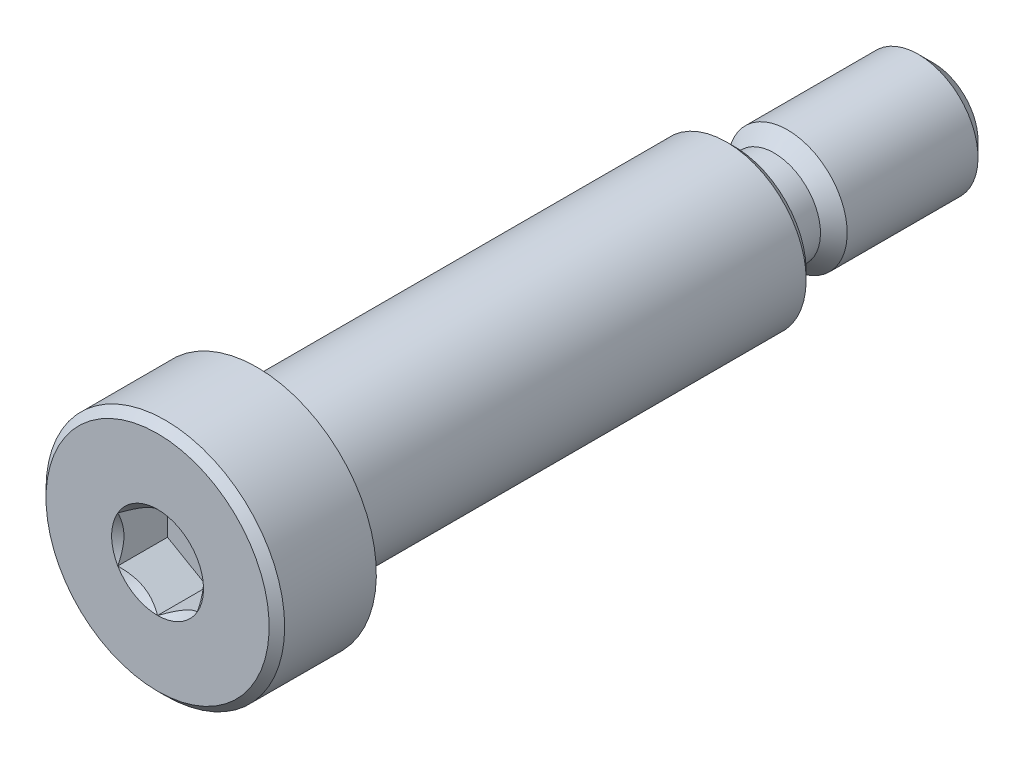
ISO-10303-21;
HEADER;
FILE_DESCRIPTION(('STEP AP214'),'2;1');
FILE_NAME('part.step','',(''),(''),'','','');
FILE_SCHEMA(('AUTOMOTIVE_DESIGN { 1 0 10303 214 1 1 1 1 }'));
ENDSEC;
DATA;
#1=APPLICATION_CONTEXT('core data for automotive mechanical design processes');
#2=APPLICATION_PROTOCOL_DEFINITION('international standard','automotive_design',2000,#1);
#3=PRODUCT_CONTEXT('',#1,'mechanical');
#4=PRODUCT('Part','Part','',(#3));
#5=PRODUCT_RELATED_PRODUCT_CATEGORY('part','',(#4));
#6=PRODUCT_DEFINITION_FORMATION('','',#4);
#7=PRODUCT_DEFINITION_CONTEXT('part definition',#1,'design');
#8=PRODUCT_DEFINITION('design','',#6,#7);
#9=PRODUCT_DEFINITION_SHAPE('','',#8);
#10=(LENGTH_UNIT() NAMED_UNIT(*) SI_UNIT(.MILLI.,.METRE.));
#11=(NAMED_UNIT(*) PLANE_ANGLE_UNIT() SI_UNIT($,.RADIAN.));
#12=(NAMED_UNIT(*) SI_UNIT($,.STERADIAN.) SOLID_ANGLE_UNIT());
#13=UNCERTAINTY_MEASURE_WITH_UNIT(LENGTH_MEASURE(1.E-05),#10,'distance_accuracy_value','');
#14=(GEOMETRIC_REPRESENTATION_CONTEXT(3) GLOBAL_UNCERTAINTY_ASSIGNED_CONTEXT((#13)) GLOBAL_UNIT_ASSIGNED_CONTEXT((#10,
#11,#12)) REPRESENTATION_CONTEXT('',''));
#15=CARTESIAN_POINT('',(0.,0.,0.));
#16=DIRECTION('',(0.,0.,1.));
#17=DIRECTION('',(1.,0.,0.));
#18=AXIS2_PLACEMENT_3D('',#15,#16,#17);
#19=CARTESIAN_POINT('',(0.,0.,0.));
#20=DIRECTION('',(0.,0.,1.));
#21=DIRECTION('',(0.,-1.,0.));
#22=AXIS2_PLACEMENT_3D('',#19,#20,#21);
#23=PLANE('',#22);
#24=CARTESIAN_POINT('',(0.,0.,0.));
#25=DIRECTION('',(0.,0.,1.));
#26=DIRECTION('',(1.,0.,0.));
#27=AXIS2_PLACEMENT_3D('',#24,#25,#26);
#28=CIRCLE('',#27,3.66617420935412);
#29=CARTESIAN_POINT('',(0.,-3.66617420935412,0.));
#30=VERTEX_POINT('',#29);
#31=CARTESIAN_POINT('',(3.175,-1.83308710467707,0.));
#32=VERTEX_POINT('',#31);
#33=EDGE_CURVE('E55',#30,#32,#28,.T.);
#34=ORIENTED_EDGE('',*,*,#33,.F.);
#35=CARTESIAN_POINT('',(-3.175,-1.83308710467706,0.));
#36=VERTEX_POINT('',#35);
#37=EDGE_CURVE('E62',#36,#30,#28,.T.);
#38=ORIENTED_EDGE('',*,*,#37,.F.);
#39=CARTESIAN_POINT('',(-3.175,1.83308710467706,0.));
#40=VERTEX_POINT('',#39);
#41=EDGE_CURVE('E135',#40,#36,#28,.T.);
#42=ORIENTED_EDGE('',*,*,#41,.F.);
#43=CARTESIAN_POINT('',(0.,3.66617420935412,0.));
#44=VERTEX_POINT('',#43);
#45=EDGE_CURVE('E130',#44,#40,#28,.T.);
#46=ORIENTED_EDGE('',*,*,#45,.F.);
#47=CARTESIAN_POINT('',(3.175,1.83308710467706,0.));
#48=VERTEX_POINT('',#47);
#49=EDGE_CURVE('E103',#48,#44,#28,.T.);
#50=ORIENTED_EDGE('',*,*,#49,.F.);
#51=EDGE_CURVE('E94',#32,#48,#28,.T.);
#52=ORIENTED_EDGE('',*,*,#51,.F.);
#53=EDGE_LOOP('',(#34,#38,#42,#46,#50,#52));
#54=FACE_BOUND('',#53,.T.);
#55=CARTESIAN_POINT('',(0.,0.,0.));
#56=DIRECTION('',(0.,0.,1.));
#57=DIRECTION('',(0.,-1.,0.));
#58=AXIS2_PLACEMENT_3D('',#55,#56,#57);
#59=CIRCLE('',#58,8.90587499999999);
#60=CARTESIAN_POINT('',(0.,-8.90587499999999,0.));
#61=VERTEX_POINT('',#60);
#62=EDGE_CURVE('E49',#61,#61,#59,.T.);
#63=ORIENTED_EDGE('',*,*,#62,.T.);
#64=EDGE_LOOP('',(#63));
#65=FACE_BOUND('',#64,.T.);
#66=ADVANCED_FACE('F35',(#54,#65),#23,.T.);
#67=CARTESIAN_POINT('',(0.,0.,-61.9125));
#68=DIRECTION('',(0.,0.,-1.));
#69=DIRECTION('',(0.,1.,0.));
#70=AXIS2_PLACEMENT_3D('',#67,#68,#69);
#71=CYLINDRICAL_SURFACE('',#70,9.525);
#72=CARTESIAN_POINT('',(0.,0.,-0.619125000000019));
#73=DIRECTION('',(0.,0.,1.));
#74=DIRECTION('',(0.,-1.,0.));
#75=AXIS2_PLACEMENT_3D('',#72,#73,#74);
#76=CIRCLE('',#75,9.525);
#77=CARTESIAN_POINT('',(0.,-9.525,-0.619125000000019));
#78=VERTEX_POINT('',#77);
#79=EDGE_CURVE('E227',#78,#78,#76,.F.);
#80=ORIENTED_EDGE('',*,*,#79,.T.);
#81=EDGE_LOOP('',(#80));
#82=FACE_BOUND('',#81,.T.);
#83=CARTESIAN_POINT('',(0.,0.,-7.93750000000001));
#84=DIRECTION('',(0.,0.,-1.));
#85=DIRECTION('',(0.,1.,0.));
#86=AXIS2_PLACEMENT_3D('',#83,#84,#85);
#87=CIRCLE('',#86,9.525);
#88=CARTESIAN_POINT('',(0.,9.525,-7.93750000000001));
#89=VERTEX_POINT('',#88);
#90=EDGE_CURVE('E242',#89,#89,#87,.T.);
#91=ORIENTED_EDGE('',*,*,#90,.F.);
#92=EDGE_LOOP('',(#91));
#93=FACE_BOUND('',#92,.T.);
#94=ADVANCED_FACE('F196',(#82,#93),#71,.T.);
#95=CARTESIAN_POINT('',(0.,-9.525,-7.93750000000001));
#96=DIRECTION('',(0.,0.,-1.));
#97=DIRECTION('',(0.,1.,0.));
#98=AXIS2_PLACEMENT_3D('',#95,#96,#97);
#99=PLANE('',#98);
#100=ORIENTED_EDGE('',*,*,#90,.T.);
#101=EDGE_LOOP('',(#100));
#102=FACE_BOUND('',#101,.T.);
#103=CARTESIAN_POINT('',(0.,0.,-7.93750000000001));
#104=DIRECTION('',(0.,0.,-1.));
#105=DIRECTION('',(0.,1.,0.));
#106=AXIS2_PLACEMENT_3D('',#103,#104,#105);
#107=CIRCLE('',#106,6.34999999999999);
#108=CARTESIAN_POINT('',(0.,6.34999999999999,-7.93750000000001));
#109=VERTEX_POINT('',#108);
#110=EDGE_CURVE('E244',#109,#109,#107,.T.);
#111=ORIENTED_EDGE('',*,*,#110,.F.);
#112=EDGE_LOOP('',(#111));
#113=FACE_BOUND('',#112,.T.);
#114=ADVANCED_FACE('F201',(#102,#113),#99,.T.);
#115=CARTESIAN_POINT('',(0.,0.,-61.9125));
#116=DIRECTION('',(0.,0.,-1.));
#117=DIRECTION('',(0.,1.,0.));
#118=AXIS2_PLACEMENT_3D('',#115,#116,#117);
#119=CYLINDRICAL_SURFACE('',#118,6.35);
#120=CARTESIAN_POINT('',(0.,0.,-45.418375));
#121=DIRECTION('',(0.,0.,-1.));
#122=DIRECTION('',(0.,1.,0.));
#123=AXIS2_PLACEMENT_3D('',#120,#121,#122);
#124=CIRCLE('',#123,6.35);
#125=CARTESIAN_POINT('',(0.,-6.34999999999999,-45.418375));
#126=VERTEX_POINT('',#125);
#127=EDGE_CURVE('E220',#126,#126,#124,.F.);
#128=ORIENTED_EDGE('',*,*,#127,.T.);
#129=EDGE_LOOP('',(#128));
#130=FACE_BOUND('',#129,.T.);
#131=ORIENTED_EDGE('',*,*,#110,.T.);
#132=EDGE_LOOP('',(#131));
#133=FACE_BOUND('',#132,.T.);
#134=ADVANCED_FACE('F345',(#130,#133),#119,.T.);
#135=CARTESIAN_POINT('',(0.,-6.35,-46.0375));
#136=DIRECTION('',(0.,0.,-1.));
#137=DIRECTION('',(0.,1.,0.));
#138=AXIS2_PLACEMENT_3D('',#135,#136,#137);
#139=PLANE('',#138);
#140=CARTESIAN_POINT('',(0.,0.,-46.0375));
#141=DIRECTION('',(0.,0.,-1.));
#142=DIRECTION('',(0.,1.,0.));
#143=AXIS2_PLACEMENT_3D('',#140,#141,#142);
#144=CIRCLE('',#143,5.73087499999999);
#145=CARTESIAN_POINT('',(0.,-5.73087499999998,-46.0375));
#146=VERTEX_POINT('',#145);
#147=EDGE_CURVE('E223',#146,#146,#144,.T.);
#148=ORIENTED_EDGE('',*,*,#147,.T.);
#149=EDGE_LOOP('',(#148));
#150=FACE_BOUND('',#149,.T.);
#151=CARTESIAN_POINT('',(0.,0.,-46.0375));
#152=DIRECTION('',(0.,0.,-1.));
#153=DIRECTION('',(0.,1.,0.));
#154=AXIS2_PLACEMENT_3D('',#151,#152,#153);
#155=CIRCLE('',#154,4.7625);
#156=CARTESIAN_POINT('',(0.,4.7625,-46.0375));
#157=VERTEX_POINT('',#156);
#158=EDGE_CURVE('E253',#157,#157,#155,.T.);
#159=ORIENTED_EDGE('',*,*,#158,.F.);
#160=EDGE_LOOP('',(#159));
#161=FACE_BOUND('',#160,.T.);
#162=ADVANCED_FACE('F352',(#150,#161),#139,.T.);
#163=CARTESIAN_POINT('',(0.,0.,-47.1043));
#164=DIRECTION('',(0.,0.,-1.));
#165=DIRECTION('',(0.,1.,0.));
#166=AXIS2_PLACEMENT_3D('',#163,#164,#165);
#167=TOROIDAL_SURFACE('',#166,4.7625,1.0668);
#168=CARTESIAN_POINT('',(0.,0.,-47.1043));
#169=DIRECTION('',(0.,0.,-1.));
#170=DIRECTION('',(0.,1.,0.));
#171=AXIS2_PLACEMENT_3D('',#168,#169,#170);
#172=CIRCLE('',#171,3.6957);
#173=CARTESIAN_POINT('',(0.,3.6957,-47.1043));
#174=VERTEX_POINT('',#173);
#175=EDGE_CURVE('E257',#174,#174,#172,.T.);
#176=ORIENTED_EDGE('',*,*,#175,.F.);
#177=EDGE_LOOP('',(#176));
#178=FACE_BOUND('',#177,.T.);
#179=ORIENTED_EDGE('',*,*,#158,.T.);
#180=EDGE_LOOP('',(#179));
#181=FACE_BOUND('',#180,.T.);
#182=ADVANCED_FACE('F360',(#178,#181),#167,.F.);
#183=CARTESIAN_POINT('',(0.,0.,-61.9125));
#184=DIRECTION('',(0.,0.,-1.));
#185=DIRECTION('',(0.,1.,0.));
#186=AXIS2_PLACEMENT_3D('',#183,#184,#185);
#187=CYLINDRICAL_SURFACE('',#186,3.6957);
#188=CARTESIAN_POINT('',(0.,0.,-49.2125));
#189=DIRECTION('',(0.,0.,-1.));
#190=DIRECTION('',(0.,1.,0.));
#191=AXIS2_PLACEMENT_3D('',#188,#189,#190);
#192=CIRCLE('',#191,3.6957);
#193=CARTESIAN_POINT('',(0.,3.6957,-49.2125));
#194=VERTEX_POINT('',#193);
#195=EDGE_CURVE('E261',#194,#194,#192,.T.);
#196=ORIENTED_EDGE('',*,*,#195,.F.);
#197=EDGE_LOOP('',(#196));
#198=FACE_BOUND('',#197,.T.);
#199=ORIENTED_EDGE('',*,*,#175,.T.);
#200=EDGE_LOOP('',(#199));
#201=FACE_BOUND('',#200,.T.);
#202=ADVANCED_FACE('F386',(#198,#201),#187,.T.);
#203=CARTESIAN_POINT('',(0.,0.,-49.2125));
#204=DIRECTION('',(0.,0.,-1.));
#205=DIRECTION('',(0.,1.,0.));
#206=AXIS2_PLACEMENT_3D('',#203,#204,#205);
#207=CONICAL_SURFACE('',#206,3.6957,0.785398163397443);
#208=CARTESIAN_POINT('',(0.,0.,-50.2793));
#209=DIRECTION('',(0.,0.,-1.));
#210=DIRECTION('',(0.,1.,0.));
#211=AXIS2_PLACEMENT_3D('',#208,#209,#210);
#212=CIRCLE('',#211,4.7625);
#213=CARTESIAN_POINT('',(0.,4.7625,-50.2793));
#214=VERTEX_POINT('',#213);
#215=EDGE_CURVE('E248',#214,#214,#212,.F.);
#216=ORIENTED_EDGE('',*,*,#215,.T.);
#217=EDGE_LOOP('',(#216));
#218=FACE_BOUND('',#217,.T.);
#219=ORIENTED_EDGE('',*,*,#195,.T.);
#220=EDGE_LOOP('',(#219));
#221=FACE_BOUND('',#220,.T.);
#222=ADVANCED_FACE('F377',(#218,#221),#207,.T.);
#223=CARTESIAN_POINT('',(0.,-4.7625,-61.9125));
#224=DIRECTION('',(0.,0.,-1.));
#225=DIRECTION('',(0.,1.,0.));
#226=AXIS2_PLACEMENT_3D('',#223,#224,#225);
#227=PLANE('',#226);
#228=CARTESIAN_POINT('',(0.,0.,-61.9125));
#229=DIRECTION('',(0.,0.,-1.));
#230=DIRECTION('',(0.,1.,0.));
#231=AXIS2_PLACEMENT_3D('',#228,#229,#230);
#232=CIRCLE('',#231,3.57187500000002);
#233=CARTESIAN_POINT('',(0.,3.57187500000002,-61.9125));
#234=VERTEX_POINT('',#233);
#235=EDGE_CURVE('E230',#234,#234,#232,.T.);
#236=ORIENTED_EDGE('',*,*,#235,.T.);
#237=EDGE_LOOP('',(#236));
#238=FACE_BOUND('',#237,.T.);
#239=ADVANCED_FACE('F368',(#238),#227,.T.);
#240=CARTESIAN_POINT('',(0.,0.,-61.9125));
#241=DIRECTION('',(0.,0.,-1.));
#242=DIRECTION('',(0.,1.,0.));
#243=AXIS2_PLACEMENT_3D('',#240,#241,#242);
#244=CYLINDRICAL_SURFACE('',#243,4.7625);
#245=CARTESIAN_POINT('',(0.,0.,-60.721875));
#246=DIRECTION('',(0.,0.,-1.));
#247=DIRECTION('',(0.,1.,0.));
#248=AXIS2_PLACEMENT_3D('',#245,#246,#247);
#249=CIRCLE('',#248,4.7625);
#250=CARTESIAN_POINT('',(0.,4.7625,-60.721875));
#251=VERTEX_POINT('',#250);
#252=EDGE_CURVE('E225',#251,#251,#249,.F.);
#253=ORIENTED_EDGE('',*,*,#252,.T.);
#254=EDGE_LOOP('',(#253));
#255=FACE_BOUND('',#254,.T.);
#256=ORIENTED_EDGE('',*,*,#215,.F.);
#257=EDGE_LOOP('',(#256));
#258=FACE_BOUND('',#257,.T.);
#259=ADVANCED_FACE('F209',(#255,#258),#244,.T.);
#260=CARTESIAN_POINT('',(0.,0.,-61.9125));
#261=DIRECTION('',(0.,0.,1.));
#262=DIRECTION('',(0.,-1.,0.));
#263=AXIS2_PLACEMENT_3D('',#260,#261,#262);
#264=CONICAL_SURFACE('',#263,3.57187500000002,0.785398163397442);
#265=ORIENTED_EDGE('',*,*,#252,.F.);
#266=EDGE_LOOP('',(#265));
#267=FACE_BOUND('',#266,.T.);
#268=ORIENTED_EDGE('',*,*,#235,.F.);
#269=EDGE_LOOP('',(#268));
#270=FACE_BOUND('',#269,.T.);
#271=ADVANCED_FACE('F206',(#267,#270),#264,.T.);
#272=CARTESIAN_POINT('',(0.,0.,-46.0375));
#273=DIRECTION('',(0.,0.,1.));
#274=DIRECTION('',(0.,-1.,0.));
#275=AXIS2_PLACEMENT_3D('',#272,#273,#274);
#276=CONICAL_SURFACE('',#275,5.73087499999999,0.78539816339745);
#277=CARTESIAN_POINT('',(0.,-6.34999999999999,-45.418375));
#278=CARTESIAN_POINT('',(0.,-6.34355078124999,-45.42482421875));
#279=CARTESIAN_POINT('',(0.,-6.33710156249999,-45.4312734375));
#280=CARTESIAN_POINT('',(0.,-6.32420312499999,-45.444171875));
#281=CARTESIAN_POINT('',(0.,-6.31775390624999,-45.45062109375));
#282=CARTESIAN_POINT('',(0.,-6.30485546874999,-45.46351953125));
#283=CARTESIAN_POINT('',(0.,-6.29840624999999,-45.46996875));
#284=CARTESIAN_POINT('',(0.,-6.28550781249999,-45.4828671875));
#285=CARTESIAN_POINT('',(0.,-6.27905859374999,-45.48931640625));
#286=CARTESIAN_POINT('',(0.,-6.26616015624999,-45.50221484375));
#287=CARTESIAN_POINT('',(0.,-6.25971093749999,-45.5086640625));
#288=CARTESIAN_POINT('',(0.,-6.24681249999999,-45.5215625));
#289=CARTESIAN_POINT('',(0.,-6.24036328124999,-45.52801171875));
#290=CARTESIAN_POINT('',(0.,-6.22746484374999,-45.54091015625));
#291=CARTESIAN_POINT('',(0.,-6.22101562499999,-45.547359375));
#292=CARTESIAN_POINT('',(0.,-6.20811718749999,-45.5602578125));
#293=CARTESIAN_POINT('',(0.,-6.20166796874999,-45.56670703125));
#294=CARTESIAN_POINT('',(0.,-6.18876953124999,-45.57960546875));
#295=CARTESIAN_POINT('',(0.,-6.18232031249999,-45.5860546875));
#296=CARTESIAN_POINT('',(0.,-6.16942187499999,-45.598953125));
#297=CARTESIAN_POINT('',(0.,-6.16297265624999,-45.60540234375));
#298=CARTESIAN_POINT('',(0.,-6.15007421874999,-45.61830078125));
#299=CARTESIAN_POINT('',(0.,-6.14362499999999,-45.62475));
#300=CARTESIAN_POINT('',(0.,-6.13072656249999,-45.6376484375));
#301=CARTESIAN_POINT('',(0.,-6.12427734374999,-45.64409765625));
#302=CARTESIAN_POINT('',(0.,-6.11137890624999,-45.65699609375));
#303=CARTESIAN_POINT('',(0.,-6.10492968749999,-45.6634453125));
#304=CARTESIAN_POINT('',(0.,-6.09203124999999,-45.67634375));
#305=CARTESIAN_POINT('',(0.,-6.08558203124999,-45.68279296875));
#306=CARTESIAN_POINT('',(0.,-6.07268359374999,-45.69569140625));
#307=CARTESIAN_POINT('',(0.,-6.06623437499999,-45.702140625));
#308=CARTESIAN_POINT('',(0.,-6.05333593749999,-45.7150390625));
#309=CARTESIAN_POINT('',(0.,-6.04688671874999,-45.72148828125));
#310=CARTESIAN_POINT('',(0.,-6.03398828124999,-45.73438671875));
#311=CARTESIAN_POINT('',(0.,-6.02753906249999,-45.7408359375));
#312=CARTESIAN_POINT('',(0.,-6.01464062499999,-45.753734375));
#313=CARTESIAN_POINT('',(0.,-6.00819140624999,-45.76018359375));
#314=CARTESIAN_POINT('',(0.,-5.99529296874999,-45.77308203125));
#315=CARTESIAN_POINT('',(0.,-5.98884374999998,-45.77953125));
#316=CARTESIAN_POINT('',(0.,-5.97594531249998,-45.7924296875));
#317=CARTESIAN_POINT('',(0.,-5.96949609374999,-45.79887890625));
#318=CARTESIAN_POINT('',(0.,-5.95659765624999,-45.81177734375));
#319=CARTESIAN_POINT('',(0.,-5.95014843749999,-45.8182265625));
#320=CARTESIAN_POINT('',(0.,-5.93724999999999,-45.831125));
#321=CARTESIAN_POINT('',(0.,-5.93080078124999,-45.83757421875));
#322=CARTESIAN_POINT('',(0.,-5.91790234374998,-45.85047265625));
#323=CARTESIAN_POINT('',(0.,-5.91145312499998,-45.856921875));
#324=CARTESIAN_POINT('',(0.,-5.89855468749998,-45.8698203125));
#325=CARTESIAN_POINT('',(0.,-5.89210546874998,-45.87626953125));
#326=CARTESIAN_POINT('',(0.,-5.87920703124998,-45.88916796875));
#327=CARTESIAN_POINT('',(0.,-5.87275781249998,-45.8956171875));
#328=CARTESIAN_POINT('',(0.,-5.85985937499998,-45.908515625));
#329=CARTESIAN_POINT('',(0.,-5.85341015624998,-45.91496484375));
#330=CARTESIAN_POINT('',(0.,-5.84051171874998,-45.92786328125));
#331=CARTESIAN_POINT('',(0.,-5.83406249999998,-45.9343125));
#332=CARTESIAN_POINT('',(0.,-5.82116406249998,-45.9472109375));
#333=CARTESIAN_POINT('',(0.,-5.81471484374998,-45.95366015625));
#334=CARTESIAN_POINT('',(0.,-5.80181640624998,-45.96655859375));
#335=CARTESIAN_POINT('',(0.,-5.79536718749998,-45.9730078125));
#336=CARTESIAN_POINT('',(0.,-5.78246874999998,-45.98590625));
#337=CARTESIAN_POINT('',(0.,-5.77601953124998,-45.99235546875));
#338=CARTESIAN_POINT('',(0.,-5.76312109374998,-46.00525390625));
#339=CARTESIAN_POINT('',(0.,-5.75667187499998,-46.011703125));
#340=CARTESIAN_POINT('',(0.,-5.74377343749998,-46.0246015625));
#341=CARTESIAN_POINT('',(0.,-5.73732421874998,-46.03105078125));
#342=CARTESIAN_POINT('',(0.,-5.73087499999998,-46.0375));
#343=B_SPLINE_CURVE_WITH_KNOTS('',3,(#277,#278,#279,#280,#281,#282,#283,#284,#285,#286,#287,
#288,#289,#290,#291,#292,#293,#294,#295,#296,#297,#298,#299,#300,#301,#302,#303,#304,#305,#306,
#307,#308,#309,#310,#311,#312,#313,#314,#315,#316,#317,#318,#319,#320,#321,#322,#323,#324,#325,
#326,#327,#328,#329,#330,#331,#332,#333,#334,#335,#336,#337,#338,#339,#340,#341,#342),
.UNSPECIFIED.,.F.,.F.,(4,2,2,2,2,2,2,2,2,2,2,2,2,2,2,2,2,2,2,2,2,2,2,2,2,2,2,2,2,2,2,2,4),(0.,
0.0273617178688837,0.0547234357377674,0.0820851536066518,0.109446871475536,0.136808589344414,
0.164170307213299,0.191532025082182,0.218893742951066,0.24625546081995,0.273617178688829,
0.300978896557713,0.328340614426597,0.355702332295481,0.38306405016436,0.410425768033244,
0.437787485902128,0.465149203771012,0.492510921639895,0.519872639508775,0.547234357377659,
0.574596075246542,0.601957793115427,0.629319510984305,0.656681228853189,0.684042946722074,
0.711404664590957,0.738766382459841,0.76612810032872,0.793489818197604,0.820851536066488,
0.848213253935372,0.875574971804251),.UNSPECIFIED.);
#344=EDGE_CURVE('BSEAM208',#126,#146,#343,.T.);
#345=ORIENTED_EDGE('',*,*,#127,.F.);
#346=ORIENTED_EDGE('',*,*,#147,.F.);
#347=ORIENTED_EDGE('',*,*,#344,.T.);
#348=ORIENTED_EDGE('',*,*,#344,.F.);
#349=EDGE_LOOP('',(#345,#347,#346,#348));
#350=FACE_BOUND('',#349,.T.);
#351=ADVANCED_FACE('F208',(#350),#276,.T.);
#352=CARTESIAN_POINT('',(0.,0.,-0.619125000000019));
#353=DIRECTION('',(0.,0.,-1.));
#354=DIRECTION('',(0.,1.,0.));
#355=AXIS2_PLACEMENT_3D('',#352,#353,#354);
#356=CONICAL_SURFACE('',#355,9.525,0.785398163397443);
#357=ORIENTED_EDGE('',*,*,#62,.F.);
#358=EDGE_LOOP('',(#357));
#359=FACE_BOUND('',#358,.T.);
#360=ORIENTED_EDGE('',*,*,#79,.F.);
#361=EDGE_LOOP('',(#360));
#362=FACE_BOUND('',#361,.T.);
#363=ADVANCED_FACE('F37',(#359,#362),#356,.T.);
#364=CARTESIAN_POINT('',(0.,0.,0.));
#365=DIRECTION('',(0.,0.,1.));
#366=DIRECTION('',(1.,0.,0.));
#367=AXIS2_PLACEMENT_3D('',#364,#365,#366);
#368=CONICAL_SURFACE('',#367,3.66617420935412,0.78539816339745);
#369=ORIENTED_EDGE('',*,*,#49,.T.);
#370=CARTESIAN_POINT('',(3.1752,1.83297163462322,0.000115475508944067));
#371=CARTESIAN_POINT('',(3.06606165005017,1.89598269034567,-0.0628410163082169));
#372=CARTESIAN_POINT('',(2.95509837192206,1.9600473688431,-0.122099895765255));
#373=CARTESIAN_POINT('',(2.72883215365405,2.09068223086865,-0.230601344269443));
#374=CARTESIAN_POINT('',(2.61350769674774,2.15726483710766,-0.279783546061288));
#375=CARTESIAN_POINT('',(2.38096147751938,2.29152545937818,-0.364033541125997));
#376=CARTESIAN_POINT('',(2.26379893371885,2.35916928558036,-0.399313085500551));
#377=CARTESIAN_POINT('',(2.02689455535372,2.49594609220167,-0.45366842986518));
#378=CARTESIAN_POINT('',(1.90715995735645,2.5650748945867,-0.47278480247036));
#379=CARTESIAN_POINT('',(1.70080208124842,2.68421566990707,-0.490032869376752));
#380=CARTESIAN_POINT('',(1.61444529227085,2.73407378526963,-0.492586066386179));
#381=CARTESIAN_POINT('',(1.44187218347529,2.83370891608763,-0.488283726876735));
#382=CARTESIAN_POINT('',(1.3556559235072,2.88348589698873,-0.481424891978556));
#383=CARTESIAN_POINT('',(1.18404020841287,2.98256827629561,-0.4586901166963));
#384=CARTESIAN_POINT('',(1.09864177574673,3.03187308438378,-0.442804090312722));
#385=CARTESIAN_POINT('',(0.929311596694528,3.1296359088415,-0.402882016002049));
#386=CARTESIAN_POINT('',(0.845379738380253,3.17809398983283,-0.37884659291483));
#387=CARTESIAN_POINT('',(0.696376420715886,3.2641210953965,-0.329394765582835));
#388=CARTESIAN_POINT('',(0.630975148808269,3.30188053733771,-0.305278280699013));
#389=CARTESIAN_POINT('',(0.501346749794894,3.3767215284027,-0.253158532862845));
#390=CARTESIAN_POINT('',(0.437119658558277,3.41380305681743,-0.225155151396475));
#391=CARTESIAN_POINT('',(0.3100419654874,3.48717139711989,-0.165889434455491));
#392=CARTESIAN_POINT('',(0.247187749251276,3.52346029578352,-0.134637346645791));
#393=CARTESIAN_POINT('',(0.122643379151907,3.59536602138644,-0.0692846556080675));
#394=CARTESIAN_POINT('',(0.0609525390212909,3.63098324454239,-0.0351858004814551));
#395=CARTESIAN_POINT('',(-0.000199999999999575,3.66628967940796,0.000115475508943787));
#396=B_SPLINE_CURVE_WITH_KNOTS('',3,(#370,#371,#372,#373,#374,#375,#376,#377,#378,#379,#380,
#381,#382,#383,#384,#385,#386,#387,#388,#389,#390,#391,#392,#393,#394,#395),.UNSPECIFIED.,.F.,
.F.,(4,2,2,2,2,2,2,2,2,2,2,2,4),(0.,0.422910572436808,0.848285055427807,1.26690402276127,
1.68446903107506,1.98329272958351,2.2822211754689,2.58148426995465,2.88072442418452,
3.11844134429546,3.35616551414405,3.59316134346767,3.8300126974443),.UNSPECIFIED.);
#397=EDGE_CURVE('E11',#48,#44,#396,.T.);
#398=ORIENTED_EDGE('',*,*,#397,.F.);
#399=EDGE_LOOP('',(#369,#398));
#400=FACE_BOUND('',#399,.T.);
#401=ADVANCED_FACE('F106',(#400),#368,.F.);
#402=ORIENTED_EDGE('',*,*,#45,.T.);
#403=CARTESIAN_POINT('',(0.000200000000000467,3.66628967940796,0.000115475508943935));
#404=CARTESIAN_POINT('',(-0.108938349949825,3.60327862368552,-0.0628410163082174));
#405=CARTESIAN_POINT('',(-0.219901628077944,3.53921394518809,-0.122099895765256));
#406=CARTESIAN_POINT('',(-0.446167846345946,3.40857908316254,-0.230601344269443));
#407=CARTESIAN_POINT('',(-0.561492303252261,3.34199647692353,-0.279783546061287));
#408=CARTESIAN_POINT('',(-0.794038522480624,3.207735854653,-0.364033541125996));
#409=CARTESIAN_POINT('',(-0.911201066281148,3.14009202845083,-0.39931308550055));
#410=CARTESIAN_POINT('',(-1.14810544464628,3.00331522182952,-0.453668429865179));
#411=CARTESIAN_POINT('',(-1.26784004264355,2.93418641944448,-0.47278480247036));
#412=CARTESIAN_POINT('',(-1.47419791875158,2.81504564412411,-0.490032869376752));
#413=CARTESIAN_POINT('',(-1.56055470772915,2.76518752876156,-0.492586066386179));
#414=CARTESIAN_POINT('',(-1.73312781652471,2.66555239794355,-0.488283726876735));
#415=CARTESIAN_POINT('',(-1.8193440764928,2.61577541704245,-0.481424891978555));
#416=CARTESIAN_POINT('',(-1.99095979158713,2.51669303773558,-0.458690116696299));
#417=CARTESIAN_POINT('',(-2.07635822425327,2.4673882296474,-0.442804090312722));
#418=CARTESIAN_POINT('',(-2.24568840330547,2.36962540518969,-0.402882016002048));
#419=CARTESIAN_POINT('',(-2.32962026161975,2.32116732419836,-0.37884659291483));
#420=CARTESIAN_POINT('',(-2.47862357928411,2.23514021863469,-0.329394765582835));
#421=CARTESIAN_POINT('',(-2.54402485119173,2.19738077669348,-0.305278280699012));
#422=CARTESIAN_POINT('',(-2.67365325020511,2.12253978562849,-0.253158532862845));
#423=CARTESIAN_POINT('',(-2.73788034144172,2.08545825721376,-0.225155151396475));
#424=CARTESIAN_POINT('',(-2.8649580345126,2.01208991691129,-0.165889434455491));
#425=CARTESIAN_POINT('',(-2.92781225074872,1.97580101824767,-0.134637346645791));
#426=CARTESIAN_POINT('',(-3.05235662084809,1.90389529264474,-0.0692846556080678));
#427=CARTESIAN_POINT('',(-3.11404746097871,1.8682780694888,-0.0351858004814554));
#428=CARTESIAN_POINT('',(-3.1752,1.83297163462323,0.000115475508943606));
#429=B_SPLINE_CURVE_WITH_KNOTS('',3,(#403,#404,#405,#406,#407,#408,#409,#410,#411,#412,#413,
#414,#415,#416,#417,#418,#419,#420,#421,#422,#423,#424,#425,#426,#427,#428),.UNSPECIFIED.,.F.,
.F.,(4,2,2,2,2,2,2,2,2,2,2,2,4),(0.,0.422910572436808,0.848285055427807,1.26690402276127,
1.68446903107506,1.98329272958351,2.2822211754689,2.58148426995465,2.88072442418451,
3.11844134429546,3.35616551414405,3.59316134346766,3.8300126974443),.UNSPECIFIED.);
#430=EDGE_CURVE('E131',#44,#40,#429,.T.);
#431=ORIENTED_EDGE('',*,*,#430,.F.);
#432=EDGE_LOOP('',(#402,#431));
#433=FACE_BOUND('',#432,.T.);
#434=ADVANCED_FACE('F298',(#433),#368,.F.);
#435=ORIENTED_EDGE('',*,*,#41,.T.);
#436=CARTESIAN_POINT('',(-3.175,-3.65592387452516,1.17597452610651));
#437=CARTESIAN_POINT('',(-3.175,-3.56690614739902,1.10877955728795));
#438=CARTESIAN_POINT('',(-3.175,-3.47739001482927,1.04223411677949));
#439=CARTESIAN_POINT('',(-3.175,-3.29716433407819,0.910733107989));
#440=CARTESIAN_POINT('',(-3.175,-3.20645449195236,0.8457779430093));
#441=CARTESIAN_POINT('',(-3.175,-3.02298124672425,0.717286472588262));
#442=CARTESIAN_POINT('',(-3.175,-2.93020737789476,0.653765060519482));
#443=CARTESIAN_POINT('',(-3.175,-2.74308490461527,0.529093231239513));
#444=CARTESIAN_POINT('',(-3.175,-2.64873641209623,0.467942646518007));
#445=CARTESIAN_POINT('',(-3.175,-2.45276910629102,0.345127291468585));
#446=CARTESIAN_POINT('',(-3.175,-2.35104296923552,0.283632900035067));
#447=CARTESIAN_POINT('',(-3.175,-2.14521620329061,0.164690024110211));
#448=CARTESIAN_POINT('',(-3.175,-2.04111520164361,0.107242180628362));
#449=CARTESIAN_POINT('',(-3.175,-1.8305483898592,-0.00236807378855735));
#450=CARTESIAN_POINT('',(-3.175,-1.72409073387149,-0.05454602658689));
#451=CARTESIAN_POINT('',(-3.175,-1.50827203793058,-0.152448430174923));
#452=CARTESIAN_POINT('',(-3.175,-1.39891233941784,-0.198175803007057));
#453=CARTESIAN_POINT('',(-3.175,-1.18604701054559,-0.278193824629251));
#454=CARTESIAN_POINT('',(-3.175,-1.08277848917347,-0.313108695034414));
#455=CARTESIAN_POINT('',(-3.175,-0.873755153890324,-0.374653665073786));
#456=CARTESIAN_POINT('',(-3.175,-0.768000169236097,-0.401283193963396));
#457=CARTESIAN_POINT('',(-3.175,-0.556394353071963,-0.444423804951883));
#458=CARTESIAN_POINT('',(-3.175,-0.450579451492892,-0.461108250420231));
#459=CARTESIAN_POINT('',(-3.175,-0.237818454981045,-0.484034858218018));
#460=CARTESIAN_POINT('',(-3.175,-0.130872557680108,-0.49027881555587));
#461=CARTESIAN_POINT('',(-3.175,0.0792250150830045,-0.491860727197653));
#462=CARTESIAN_POINT('',(-3.175,0.18237391199382,-0.487585251998013));
#463=CARTESIAN_POINT('',(-3.175,0.387788153537299,-0.469217325011947));
#464=CARTESIAN_POINT('',(-3.175,0.490053411359905,-0.455123919552885));
#465=CARTESIAN_POINT('',(-3.175,0.694689208906974,-0.417649304806497));
#466=CARTESIAN_POINT('',(-3.175,0.797030337701614,-0.394110040645698));
#467=CARTESIAN_POINT('',(-3.175,0.999482692253839,-0.3389990990408));
#468=CARTESIAN_POINT('',(-3.175,1.09959410383402,-0.307428093699382));
#469=CARTESIAN_POINT('',(-3.175,1.30666025401972,-0.234302973381313));
#470=CARTESIAN_POINT('',(-3.175,1.41338058113121,-0.192091761298271));
#471=CARTESIAN_POINT('',(-3.175,1.62403512608011,-0.101194633675295));
#472=CARTESIAN_POINT('',(-3.175,1.72796839622315,-0.0525065484982067));
#473=CARTESIAN_POINT('',(-3.175,1.93357808805447,0.0501937756761229));
#474=CARTESIAN_POINT('',(-3.175,2.03524592560239,0.104223062169345));
#475=CARTESIAN_POINT('',(-3.175,2.23624195707291,0.216408901364748));
#476=CARTESIAN_POINT('',(-3.175,2.3355705197654,0.274564797656881));
#477=CARTESIAN_POINT('',(-3.175,2.52730642275902,0.391215115503931));
#478=CARTESIAN_POINT('',(-3.175,2.61981218330511,0.449548619193316));
#479=CARTESIAN_POINT('',(-3.175,2.80323560367684,0.568668649469825));
#480=CARTESIAN_POINT('',(-3.175,2.89415314246283,0.629455361859399));
#481=CARTESIAN_POINT('',(-3.175,3.07387072487129,0.752541216482857));
#482=CARTESIAN_POINT('',(-3.175,3.16268196996071,0.814824062049374));
#483=CARTESIAN_POINT('',(-3.175,3.33909075370388,0.941036832486232));
#484=CARTESIAN_POINT('',(-3.175,3.42668861940902,1.00496629970184));
#485=CARTESIAN_POINT('',(-3.175,3.51377838474595,1.06956897805668));
#486=B_SPLINE_CURVE_WITH_KNOTS('',3,(#436,#437,#438,#439,#440,#441,#442,#443,#444,#445,#446,
#447,#448,#449,#450,#451,#452,#453,#454,#455,#456,#457,#458,#459,#460,#461,#462,#463,#464,#465,
#466,#467,#468,#469,#470,#471,#472,#473,#474,#475,#476,#477,#478,#479,#480,#481,#482,#483,#484,
#485),.UNSPECIFIED.,.F.,.F.,(4,2,2,2,2,2,2,2,2,2,2,2,2,2,2,2,2,2,2,2,2,2,2,2,4),(0.,
0.334601712013315,0.669287419770511,1.00656636796479,1.3438214421939,1.70035269072413,
2.05694029057745,2.41244349871029,2.76778514705124,3.09453137075717,3.42130009774479,
3.74219200698696,4.06302874036785,4.37225254917033,4.68150639886781,4.99616636831742,
5.31080001541914,5.65482708645254,5.99896969199844,6.34424851858142,6.68947254507109,
7.01751396994993,7.34558028700741,7.67098168170701,7.99629359145139),.UNSPECIFIED.);
#487=EDGE_CURVE('E133',#40,#36,#486,.F.);
#488=ORIENTED_EDGE('',*,*,#487,.F.);
#489=EDGE_LOOP('',(#435,#488));
#490=FACE_BOUND('',#489,.T.);
#491=ADVANCED_FACE('F295',(#490),#368,.F.);
#492=ORIENTED_EDGE('',*,*,#37,.T.);
#493=CARTESIAN_POINT('',(-3.1752,-1.83297163462322,0.000115475508942766));
#494=CARTESIAN_POINT('',(-3.06606165005017,-1.89598269034567,-0.0628410163082177));
#495=CARTESIAN_POINT('',(-2.95509837192205,-1.9600473688431,-0.122099895765256));
#496=CARTESIAN_POINT('',(-2.72883215365405,-2.09068223086865,-0.230601344269444));
#497=CARTESIAN_POINT('',(-2.61350769674774,-2.15726483710766,-0.279783546061288));
#498=CARTESIAN_POINT('',(-2.38096147751938,-2.29152545937818,-0.364033541125997));
#499=CARTESIAN_POINT('',(-2.26379893371885,-2.35916928558036,-0.39931308550055));
#500=CARTESIAN_POINT('',(-2.02689455535372,-2.49594609220167,-0.453668429865179));
#501=CARTESIAN_POINT('',(-1.90715995735645,-2.5650748945867,-0.47278480247036));
#502=CARTESIAN_POINT('',(-1.70080208124842,-2.68421566990707,-0.490032869376752));
#503=CARTESIAN_POINT('',(-1.61444529227085,-2.73407378526963,-0.492586066386179));
#504=CARTESIAN_POINT('',(-1.44187218347529,-2.83370891608763,-0.488283726876735));
#505=CARTESIAN_POINT('',(-1.3556559235072,-2.88348589698873,-0.481424891978556));
#506=CARTESIAN_POINT('',(-1.18404020841287,-2.98256827629561,-0.4586901166963));
#507=CARTESIAN_POINT('',(-1.09864177574673,-3.03187308438378,-0.442804090312722));
#508=CARTESIAN_POINT('',(-0.929311596694529,-3.1296359088415,-0.402882016002049));
#509=CARTESIAN_POINT('',(-0.845379738380255,-3.17809398983283,-0.37884659291483));
#510=CARTESIAN_POINT('',(-0.696376420715887,-3.2641210953965,-0.329394765582836));
#511=CARTESIAN_POINT('',(-0.63097514880827,-3.3018805373377,-0.305278280699013));
#512=CARTESIAN_POINT('',(-0.501346749794894,-3.3767215284027,-0.253158532862846));
#513=CARTESIAN_POINT('',(-0.437119658558277,-3.41380305681742,-0.225155151396475));
#514=CARTESIAN_POINT('',(-0.3100419654874,-3.48717139711989,-0.165889434455491));
#515=CARTESIAN_POINT('',(-0.247187749251276,-3.52346029578352,-0.134637346645791));
#516=CARTESIAN_POINT('',(-0.122643379151907,-3.59536602138645,-0.0692846556080672));
#517=CARTESIAN_POINT('',(-0.0609525390212904,-3.63098324454239,-0.0351858004814547));
#518=CARTESIAN_POINT('',(0.000200000000000515,-3.66628967940796,0.000115475508944399));
#519=B_SPLINE_CURVE_WITH_KNOTS('',3,(#493,#494,#495,#496,#497,#498,#499,#500,#501,#502,#503,
#504,#505,#506,#507,#508,#509,#510,#511,#512,#513,#514,#515,#516,#517,#518),.UNSPECIFIED.,.F.,
.F.,(4,2,2,2,2,2,2,2,2,2,2,2,4),(0.,0.422910572436807,0.848285055427805,1.26690402276127,
1.68446903107506,1.98329272958351,2.2822211754689,2.58148426995465,2.88072442418451,
3.11844134429546,3.35616551414405,3.59316134346766,3.8300126974443),.UNSPECIFIED.);
#520=EDGE_CURVE('E161',#36,#30,#519,.T.);
#521=ORIENTED_EDGE('',*,*,#520,.F.);
#522=EDGE_LOOP('',(#492,#521));
#523=FACE_BOUND('',#522,.T.);
#524=ADVANCED_FACE('F304',(#523),#368,.F.);
#525=ORIENTED_EDGE('',*,*,#33,.T.);
#526=CARTESIAN_POINT('',(-0.000199999999999559,-3.66628967940796,0.000115475508944369));
#527=CARTESIAN_POINT('',(0.108938349949826,-3.60327862368552,-0.0628410163082168));
#528=CARTESIAN_POINT('',(0.219901628077945,-3.53921394518809,-0.122099895765255));
#529=CARTESIAN_POINT('',(0.446167846345946,-3.40857908316254,-0.230601344269443));
#530=CARTESIAN_POINT('',(0.561492303252262,-3.34199647692353,-0.279783546061287));
#531=CARTESIAN_POINT('',(0.794038522480625,-3.207735854653,-0.364033541125995));
#532=CARTESIAN_POINT('',(0.911201066281148,-3.14009202845083,-0.399313085500549));
#533=CARTESIAN_POINT('',(1.14810544464628,-3.00331522182952,-0.453668429865179));
#534=CARTESIAN_POINT('',(1.26784004264355,-2.93418641944448,-0.472784802470359));
#535=CARTESIAN_POINT('',(1.47419791875158,-2.81504564412412,-0.490032869376751));
#536=CARTESIAN_POINT('',(1.56055470772915,-2.76518752876156,-0.492586066386178));
#537=CARTESIAN_POINT('',(1.73312781652471,-2.66555239794355,-0.488283726876734));
#538=CARTESIAN_POINT('',(1.8193440764928,-2.61577541704246,-0.481424891978554));
#539=CARTESIAN_POINT('',(1.99095979158713,-2.51669303773558,-0.458690116696299));
#540=CARTESIAN_POINT('',(2.07635822425327,-2.46738822964741,-0.442804090312722));
#541=CARTESIAN_POINT('',(2.24568840330547,-2.36962540518969,-0.402882016002048));
#542=CARTESIAN_POINT('',(2.32962026161975,-2.32116732419836,-0.378846592914829));
#543=CARTESIAN_POINT('',(2.47862357928411,-2.23514021863469,-0.329394765582835));
#544=CARTESIAN_POINT('',(2.54402485119173,-2.19738077669348,-0.305278280699012));
#545=CARTESIAN_POINT('',(2.67365325020511,-2.12253978562849,-0.253158532862845));
#546=CARTESIAN_POINT('',(2.73788034144172,-2.08545825721376,-0.225155151396474));
#547=CARTESIAN_POINT('',(2.8649580345126,-2.01208991691129,-0.165889434455489));
#548=CARTESIAN_POINT('',(2.92781225074872,-1.97580101824767,-0.13463734664579));
#549=CARTESIAN_POINT('',(3.05235662084809,-1.90389529264474,-0.069284655608067));
#550=CARTESIAN_POINT('',(3.11404746097871,-1.8682780694888,-0.0351858004814548));
#551=CARTESIAN_POINT('',(3.1752,-1.83297163462323,0.000115475508944523));
#552=B_SPLINE_CURVE_WITH_KNOTS('',3,(#526,#527,#528,#529,#530,#531,#532,#533,#534,#535,#536,
#537,#538,#539,#540,#541,#542,#543,#544,#545,#546,#547,#548,#549,#550,#551),.UNSPECIFIED.,.F.,
.F.,(4,2,2,2,2,2,2,2,2,2,2,2,4),(0.,0.422910572436807,0.848285055427807,1.26690402276127,
1.68446903107506,1.98329272958351,2.2822211754689,2.58148426995465,2.88072442418451,
3.11844134429546,3.35616551414405,3.59316134346767,3.8300126974443),.UNSPECIFIED.);
#553=EDGE_CURVE('E118',#30,#32,#552,.T.);
#554=ORIENTED_EDGE('',*,*,#553,.F.);
#555=EDGE_LOOP('',(#525,#554));
#556=FACE_BOUND('',#555,.T.);
#557=ADVANCED_FACE('F154',(#556),#368,.F.);
#558=ORIENTED_EDGE('',*,*,#51,.T.);
#559=CARTESIAN_POINT('',(3.175,-3.65592387452516,1.17597452610651));
#560=CARTESIAN_POINT('',(3.175,-3.56690614739902,1.10877955728796));
#561=CARTESIAN_POINT('',(3.175,-3.47739001482927,1.0422341167795));
#562=CARTESIAN_POINT('',(3.175,-3.29716433407819,0.910733107989002));
#563=CARTESIAN_POINT('',(3.175,-3.20645449195236,0.845777943009302));
#564=CARTESIAN_POINT('',(3.175,-3.02298124672425,0.717286472588264));
#565=CARTESIAN_POINT('',(3.175,-2.93020737789476,0.653765060519483));
#566=CARTESIAN_POINT('',(3.175,-2.74308490461527,0.529093231239516));
#567=CARTESIAN_POINT('',(3.175,-2.64873641209623,0.46794264651801));
#568=CARTESIAN_POINT('',(3.175,-2.45276910629102,0.345127291468587));
#569=CARTESIAN_POINT('',(3.175,-2.35104296923552,0.283632900035069));
#570=CARTESIAN_POINT('',(3.175,-2.14521620329061,0.164690024110213));
#571=CARTESIAN_POINT('',(3.175,-2.04111520164361,0.107242180628364));
#572=CARTESIAN_POINT('',(3.175,-1.8305483898592,-0.0023680737885556));
#573=CARTESIAN_POINT('',(3.175,-1.72409073387149,-0.0545460265868883));
#574=CARTESIAN_POINT('',(3.175,-1.50827203793058,-0.152448430174921));
#575=CARTESIAN_POINT('',(3.175,-1.39891233941784,-0.198175803007056));
#576=CARTESIAN_POINT('',(3.175,-1.18604701054559,-0.278193824629249));
#577=CARTESIAN_POINT('',(3.175,-1.08277848917347,-0.313108695034413));
#578=CARTESIAN_POINT('',(3.175,-0.873755153890323,-0.374653665073785));
#579=CARTESIAN_POINT('',(3.175,-0.768000169236097,-0.401283193963395));
#580=CARTESIAN_POINT('',(3.175,-0.556394353071963,-0.444423804951881));
#581=CARTESIAN_POINT('',(3.175,-0.450579451492892,-0.461108250420229));
#582=CARTESIAN_POINT('',(3.175,-0.237818454981044,-0.484034858218017));
#583=CARTESIAN_POINT('',(3.175,-0.130872557680107,-0.490278815555869));
#584=CARTESIAN_POINT('',(3.175,0.079225015083005,-0.491860727197651));
#585=CARTESIAN_POINT('',(3.175,0.18237391199382,-0.487585251998011));
#586=CARTESIAN_POINT('',(3.175,0.387788153537299,-0.469217325011945));
#587=CARTESIAN_POINT('',(3.175,0.490053411359906,-0.455123919552883));
#588=CARTESIAN_POINT('',(3.175,0.694689208906975,-0.417649304806496));
#589=CARTESIAN_POINT('',(3.175,0.797030337701615,-0.394110040645697));
#590=CARTESIAN_POINT('',(3.175,0.999482692253839,-0.338999099040798));
#591=CARTESIAN_POINT('',(3.175,1.09959410383402,-0.307428093699381));
#592=CARTESIAN_POINT('',(3.175,1.30666025401972,-0.234302973381311));
#593=CARTESIAN_POINT('',(3.175,1.41338058113121,-0.19209176129827));
#594=CARTESIAN_POINT('',(3.175,1.62403512608011,-0.101194633675294));
#595=CARTESIAN_POINT('',(3.175,1.72796839622315,-0.0525065484982055));
#596=CARTESIAN_POINT('',(3.175,1.93357808805447,0.0501937756761243));
#597=CARTESIAN_POINT('',(3.175,2.03524592560239,0.104223062169346));
#598=CARTESIAN_POINT('',(3.175,2.23624195707291,0.216408901364749));
#599=CARTESIAN_POINT('',(3.175,2.3355705197654,0.274564797656882));
#600=CARTESIAN_POINT('',(3.175,2.52730642275902,0.391215115503932));
#601=CARTESIAN_POINT('',(3.175,2.61981218330511,0.449548619193317));
#602=CARTESIAN_POINT('',(3.175,2.80323560367684,0.568668649469825));
#603=CARTESIAN_POINT('',(3.175,2.89415314246283,0.6294553618594));
#604=CARTESIAN_POINT('',(3.175,3.07387072487129,0.752541216482857));
#605=CARTESIAN_POINT('',(3.175,3.16268196996071,0.814824062049374));
#606=CARTESIAN_POINT('',(3.175,3.33909075370388,0.941036832486232));
#607=CARTESIAN_POINT('',(3.175,3.42668861940902,1.00496629970184));
#608=CARTESIAN_POINT('',(3.175,3.51377838474595,1.06956897805668));
#609=B_SPLINE_CURVE_WITH_KNOTS('',3,(#559,#560,#561,#562,#563,#564,#565,#566,#567,#568,#569,
#570,#571,#572,#573,#574,#575,#576,#577,#578,#579,#580,#581,#582,#583,#584,#585,#586,#587,#588,
#589,#590,#591,#592,#593,#594,#595,#596,#597,#598,#599,#600,#601,#602,#603,#604,#605,#606,#607,
#608),.UNSPECIFIED.,.F.,.F.,(4,2,2,2,2,2,2,2,2,2,2,2,2,2,2,2,2,2,2,2,2,2,2,2,4),(0.,
0.334601712013315,0.669287419770511,1.00656636796479,1.3438214421939,1.70035269072413,
2.05694029057745,2.41244349871029,2.76778514705124,3.09453137075717,3.42130009774479,
3.74219200698696,4.06302874036785,4.37225254917033,4.68150639886781,4.99616636831742,
5.31080001541914,5.65482708645254,5.99896969199844,6.34424851858142,6.68947254507109,
7.01751396994993,7.34558028700741,7.67098168170701,7.99629359145139),.UNSPECIFIED.);
#610=EDGE_CURVE('E98',#32,#48,#609,.T.);
#611=ORIENTED_EDGE('',*,*,#610,.F.);
#612=EDGE_LOOP('',(#558,#611));
#613=FACE_BOUND('',#612,.T.);
#614=ADVANCED_FACE('F96',(#613),#368,.F.);
#615=CARTESIAN_POINT('',(0.,0.,-3.96875));
#616=DIRECTION('',(0.,0.,1.));
#617=DIRECTION('',(1.,0.,0.));
#618=AXIS2_PLACEMENT_3D('',#615,#616,#617);
#619=PLANE('',#618);
#620=DIRECTION('',(0.,1.,0.));
#621=VECTOR('',#620,1.);
#622=CARTESIAN_POINT('',(3.175,-1.83308710467706,-3.96875));
#623=LINE('',#622,#621);
#624=CARTESIAN_POINT('',(3.175,-1.83308710467706,-3.96875));
#625=VERTEX_POINT('',#624);
#626=CARTESIAN_POINT('',(3.175,1.83308710467706,-3.96875));
#627=VERTEX_POINT('',#626);
#628=EDGE_CURVE('E117',#625,#627,#623,.T.);
#629=ORIENTED_EDGE('',*,*,#628,.T.);
#630=DIRECTION('',(-0.866025403784439,0.5,0.));
#631=VECTOR('',#630,1.);
#632=CARTESIAN_POINT('',(3.175,1.83308710467706,-3.96875));
#633=LINE('',#632,#631);
#634=CARTESIAN_POINT('',(0.,3.66617420935412,-3.96875));
#635=VERTEX_POINT('',#634);
#636=EDGE_CURVE('E122',#627,#635,#633,.T.);
#637=ORIENTED_EDGE('',*,*,#636,.T.);
#638=DIRECTION('',(-0.866025403784439,-0.5,0.));
#639=VECTOR('',#638,1.);
#640=CARTESIAN_POINT('',(0.,3.66617420935412,-3.96875));
#641=LINE('',#640,#639);
#642=CARTESIAN_POINT('',(-3.175,1.83308710467706,-3.96875));
#643=VERTEX_POINT('',#642);
#644=EDGE_CURVE('E283',#635,#643,#641,.T.);
#645=ORIENTED_EDGE('',*,*,#644,.T.);
#646=DIRECTION('',(0.,-1.,0.));
#647=VECTOR('',#646,1.);
#648=CARTESIAN_POINT('',(-3.175,1.83308710467706,-3.96875));
#649=LINE('',#648,#647);
#650=CARTESIAN_POINT('',(-3.175,-1.83308710467706,-3.96875));
#651=VERTEX_POINT('',#650);
#652=EDGE_CURVE('E280',#643,#651,#649,.T.);
#653=ORIENTED_EDGE('',*,*,#652,.T.);
#654=DIRECTION('',(0.866025403784439,-0.5,0.));
#655=VECTOR('',#654,1.);
#656=CARTESIAN_POINT('',(-3.175,-1.83308710467706,-3.96875));
#657=LINE('',#656,#655);
#658=CARTESIAN_POINT('',(0.,-3.66617420935412,-3.96875));
#659=VERTEX_POINT('',#658);
#660=EDGE_CURVE('E277',#651,#659,#657,.T.);
#661=ORIENTED_EDGE('',*,*,#660,.T.);
#662=DIRECTION('',(0.866025403784439,0.5,0.));
#663=VECTOR('',#662,1.);
#664=CARTESIAN_POINT('',(0.,-3.66617420935412,-3.96875));
#665=LINE('',#664,#663);
#666=EDGE_CURVE('E125',#659,#625,#665,.T.);
#667=ORIENTED_EDGE('',*,*,#666,.T.);
#668=EDGE_LOOP('',(#629,#637,#645,#653,#661,#667));
#669=FACE_BOUND('',#668,.T.);
#670=ADVANCED_FACE('F153',(#669),#619,.T.);
#671=CARTESIAN_POINT('',(3.175,1.83308710467706,-3.96875));
#672=DIRECTION('',(0.5,0.866025403784439,0.));
#673=DIRECTION('',(-0.866025403784439,0.5,0.));
#674=AXIS2_PLACEMENT_3D('',#671,#672,#673);
#675=PLANE('',#674);
#676=DIRECTION('',(0.,0.,1.));
#677=VECTOR('',#676,1.);
#678=CARTESIAN_POINT('',(3.175,1.83308710467706,-3.96875));
#679=LINE('',#678,#677);
#680=EDGE_CURVE('E114',#627,#48,#679,.T.);
#681=ORIENTED_EDGE('',*,*,#680,.T.);
#682=ORIENTED_EDGE('',*,*,#397,.T.);
#683=DIRECTION('',(0.,0.,1.));
#684=VECTOR('',#683,1.);
#685=CARTESIAN_POINT('',(0.,3.66617420935412,-3.96875));
#686=LINE('',#685,#684);
#687=EDGE_CURVE('E124',#635,#44,#686,.T.);
#688=ORIENTED_EDGE('',*,*,#687,.F.);
#689=ORIENTED_EDGE('',*,*,#636,.F.);
#690=EDGE_LOOP('',(#681,#682,#688,#689));
#691=FACE_BOUND('',#690,.T.);
#692=ADVANCED_FACE('F120',(#691),#675,.F.);
#693=CARTESIAN_POINT('',(0.,3.66617420935412,-3.96875));
#694=DIRECTION('',(-0.5,0.866025403784439,0.));
#695=DIRECTION('',(-0.866025403784439,-0.5,0.));
#696=AXIS2_PLACEMENT_3D('',#693,#694,#695);
#697=PLANE('',#696);
#698=ORIENTED_EDGE('',*,*,#687,.T.);
#699=ORIENTED_EDGE('',*,*,#430,.T.);
#700=DIRECTION('',(0.,0.,1.));
#701=VECTOR('',#700,1.);
#702=CARTESIAN_POINT('',(-3.175,1.83308710467706,-3.96875));
#703=LINE('',#702,#701);
#704=EDGE_CURVE('E267',#643,#40,#703,.T.);
#705=ORIENTED_EDGE('',*,*,#704,.F.);
#706=ORIENTED_EDGE('',*,*,#644,.F.);
#707=EDGE_LOOP('',(#698,#699,#705,#706));
#708=FACE_BOUND('',#707,.T.);
#709=ADVANCED_FACE('F148',(#708),#697,.F.);
#710=CARTESIAN_POINT('',(-3.175,1.83308710467706,-3.96875));
#711=DIRECTION('',(-1.,0.,0.));
#712=DIRECTION('',(0.,-1.,0.));
#713=AXIS2_PLACEMENT_3D('',#710,#711,#712);
#714=PLANE('',#713);
#715=ORIENTED_EDGE('',*,*,#704,.T.);
#716=ORIENTED_EDGE('',*,*,#487,.T.);
#717=DIRECTION('',(0.,0.,1.));
#718=VECTOR('',#717,1.);
#719=CARTESIAN_POINT('',(-3.175,-1.83308710467706,-3.96875));
#720=LINE('',#719,#718);
#721=EDGE_CURVE('E269',#651,#36,#720,.T.);
#722=ORIENTED_EDGE('',*,*,#721,.F.);
#723=ORIENTED_EDGE('',*,*,#652,.F.);
#724=EDGE_LOOP('',(#715,#716,#722,#723));
#725=FACE_BOUND('',#724,.T.);
#726=ADVANCED_FACE('F185',(#725),#714,.F.);
#727=CARTESIAN_POINT('',(-3.175,-1.83308710467706,-3.96875));
#728=DIRECTION('',(-0.5,-0.866025403784439,0.));
#729=DIRECTION('',(0.866025403784439,-0.5,0.));
#730=AXIS2_PLACEMENT_3D('',#727,#728,#729);
#731=PLANE('',#730);
#732=ORIENTED_EDGE('',*,*,#721,.T.);
#733=ORIENTED_EDGE('',*,*,#520,.T.);
#734=DIRECTION('',(0.,0.,1.));
#735=VECTOR('',#734,1.);
#736=CARTESIAN_POINT('',(0.,-3.66617420935412,-3.96875));
#737=LINE('',#736,#735);
#738=EDGE_CURVE('E271',#659,#30,#737,.T.);
#739=ORIENTED_EDGE('',*,*,#738,.F.);
#740=ORIENTED_EDGE('',*,*,#660,.F.);
#741=EDGE_LOOP('',(#732,#733,#739,#740));
#742=FACE_BOUND('',#741,.T.);
#743=ADVANCED_FACE('F181',(#742),#731,.F.);
#744=CARTESIAN_POINT('',(0.,-3.66617420935412,-3.96875));
#745=DIRECTION('',(0.5,-0.866025403784439,0.));
#746=DIRECTION('',(0.866025403784439,0.5,0.));
#747=AXIS2_PLACEMENT_3D('',#744,#745,#746);
#748=PLANE('',#747);
#749=ORIENTED_EDGE('',*,*,#738,.T.);
#750=ORIENTED_EDGE('',*,*,#553,.T.);
#751=DIRECTION('',(0.,0.,1.));
#752=VECTOR('',#751,1.);
#753=CARTESIAN_POINT('',(3.175,-1.83308710467706,-3.96875));
#754=LINE('',#753,#752);
#755=EDGE_CURVE('E116',#625,#32,#754,.T.);
#756=ORIENTED_EDGE('',*,*,#755,.F.);
#757=ORIENTED_EDGE('',*,*,#666,.F.);
#758=EDGE_LOOP('',(#749,#750,#756,#757));
#759=FACE_BOUND('',#758,.T.);
#760=ADVANCED_FACE('F178',(#759),#748,.F.);
#761=CARTESIAN_POINT('',(3.175,-1.83308710467706,-3.96875));
#762=DIRECTION('',(1.,0.,0.));
#763=DIRECTION('',(0.,0.,-1.));
#764=AXIS2_PLACEMENT_3D('',#761,#762,#763);
#765=PLANE('',#764);
#766=ORIENTED_EDGE('',*,*,#755,.T.);
#767=ORIENTED_EDGE('',*,*,#610,.T.);
#768=ORIENTED_EDGE('',*,*,#680,.F.);
#769=ORIENTED_EDGE('',*,*,#628,.F.);
#770=EDGE_LOOP('',(#766,#767,#768,#769));
#771=FACE_BOUND('',#770,.T.);
#772=ADVANCED_FACE('F112',(#771),#765,.F.);
#773=CLOSED_SHELL('',(#66,#94,#114,#134,#162,#182,#202,#222,#239,#259,#271,#351,#363,#401,#434,
#491,#524,#557,#614,#670,#692,#709,#726,#743,#760,#772));
#774=MANIFOLD_SOLID_BREP('B2',#773);
#775=ADVANCED_BREP_SHAPE_REPRESENTATION('',(#18,#774),#14);
#776=SHAPE_DEFINITION_REPRESENTATION(#9,#775);
ENDSEC;
END-ISO-10303-21;
